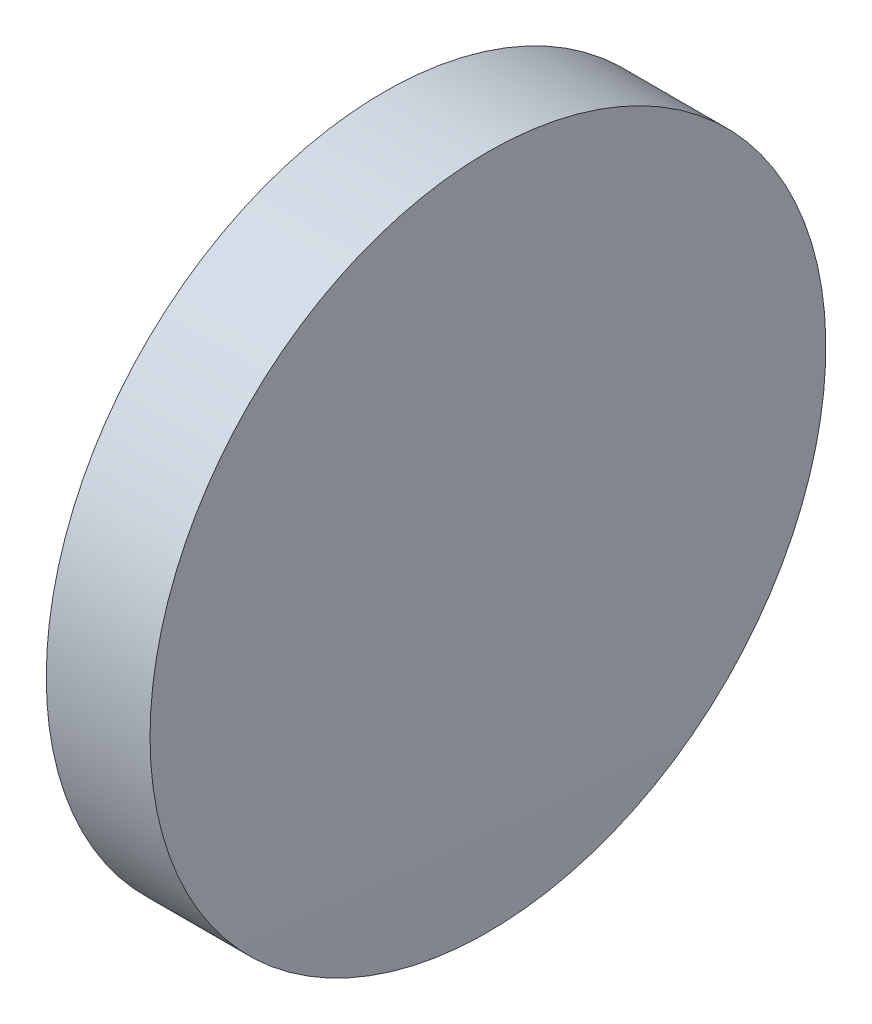
ISO-10303-21;
HEADER;
FILE_DESCRIPTION(('STEP AP214'),'2;1');
FILE_NAME('part.step','',(''),(''),'','','');
FILE_SCHEMA(('AUTOMOTIVE_DESIGN { 1 0 10303 214 1 1 1 1 }'));
ENDSEC;
DATA;
#1=APPLICATION_CONTEXT('core data for automotive mechanical design processes');
#2=APPLICATION_PROTOCOL_DEFINITION('international standard','automotive_design',2000,#1);
#3=PRODUCT_CONTEXT('',#1,'mechanical');
#4=PRODUCT('Part','Part','',(#3));
#5=PRODUCT_RELATED_PRODUCT_CATEGORY('part','',(#4));
#6=PRODUCT_DEFINITION_FORMATION('','',#4);
#7=PRODUCT_DEFINITION_CONTEXT('part definition',#1,'design');
#8=PRODUCT_DEFINITION('design','',#6,#7);
#9=PRODUCT_DEFINITION_SHAPE('','',#8);
#10=(LENGTH_UNIT() NAMED_UNIT(*) SI_UNIT(.MILLI.,.METRE.));
#11=(NAMED_UNIT(*) PLANE_ANGLE_UNIT() SI_UNIT($,.RADIAN.));
#12=(NAMED_UNIT(*) SI_UNIT($,.STERADIAN.) SOLID_ANGLE_UNIT());
#13=UNCERTAINTY_MEASURE_WITH_UNIT(LENGTH_MEASURE(1.E-05),#10,'distance_accuracy_value','');
#14=(GEOMETRIC_REPRESENTATION_CONTEXT(3) GLOBAL_UNCERTAINTY_ASSIGNED_CONTEXT((#13)) GLOBAL_UNIT_ASSIGNED_CONTEXT((#10,
#11,#12)) REPRESENTATION_CONTEXT('',''));
#15=CARTESIAN_POINT('',(0.,0.,0.));
#16=DIRECTION('',(0.,0.,1.));
#17=DIRECTION('',(1.,0.,0.));
#18=AXIS2_PLACEMENT_3D('',#15,#16,#17);
#19=CARTESIAN_POINT('',(-686.735444523844,65.2335549264104,0.));
#20=DIRECTION('',(-1.,0.,0.));
#21=DIRECTION('',(0.,1.,0.));
#22=AXIS2_PLACEMENT_3D('',#19,#20,#21);
#23=SPHERICAL_SURFACE('',#22,806.500000000046);
#24=CARTESIAN_POINT('',(119.664555476201,65.2335549264122,0.));
#25=DIRECTION('',(-1.,0.,0.));
#26=DIRECTION('',(0.,0.,1.));
#27=AXIS2_PLACEMENT_3D('',#24,#25,#26);
#28=CIRCLE('',#27,12.7);
#29=CARTESIAN_POINT('',(119.664555476201,65.2335549264122,12.7));
#30=VERTEX_POINT('',#29);
#31=EDGE_CURVE('E10',#30,#30,#28,.T.);
#32=ORIENTED_EDGE('',*,*,#31,.F.);
#33=EDGE_LOOP('',(#32));
#34=FACE_BOUND('',#33,.T.);
#35=ADVANCED_FACE('F35',(#34),#23,.T.);
#36=CARTESIAN_POINT('',(110.165373228488,65.2335549264122,0.));
#37=DIRECTION('',(-1.,0.,0.));
#38=DIRECTION('',(0.,0.,1.));
#39=AXIS2_PLACEMENT_3D('',#36,#37,#38);
#40=CYLINDRICAL_SURFACE('',#39,12.7);
#41=CARTESIAN_POINT('',(115.764555476201,65.2335549264122,0.));
#42=DIRECTION('',(-1.,0.,0.));
#43=DIRECTION('',(0.,0.,1.));
#44=AXIS2_PLACEMENT_3D('',#41,#42,#43);
#45=CIRCLE('',#44,12.7);
#46=CARTESIAN_POINT('',(115.764555476201,65.2335549264122,12.7));
#47=VERTEX_POINT('',#46);
#48=EDGE_CURVE('E41',#47,#47,#45,.T.);
#49=ORIENTED_EDGE('',*,*,#48,.F.);
#50=EDGE_LOOP('',(#49));
#51=FACE_BOUND('',#50,.T.);
#52=ORIENTED_EDGE('',*,*,#31,.T.);
#53=EDGE_LOOP('',(#52));
#54=FACE_BOUND('',#53,.T.);
#55=ADVANCED_FACE('F49',(#51,#54),#40,.T.);
#56=CARTESIAN_POINT('',(115.764555476201,65.2335549264122,0.));
#57=DIRECTION('',(1.,0.,0.));
#58=DIRECTION('',(0.,0.,-1.));
#59=AXIS2_PLACEMENT_3D('',#56,#57,#58);
#60=PLANE('',#59);
#61=ORIENTED_EDGE('',*,*,#48,.T.);
#62=EDGE_LOOP('',(#61));
#63=FACE_BOUND('',#62,.T.);
#64=ADVANCED_FACE('F47',(#63),#60,.F.);
#65=CLOSED_SHELL('',(#35,#55,#64));
#66=MANIFOLD_SOLID_BREP('B2',#65);
#67=ADVANCED_BREP_SHAPE_REPRESENTATION('',(#18,#66),#14);
#68=SHAPE_DEFINITION_REPRESENTATION(#9,#67);
ENDSEC;
END-ISO-10303-21;
